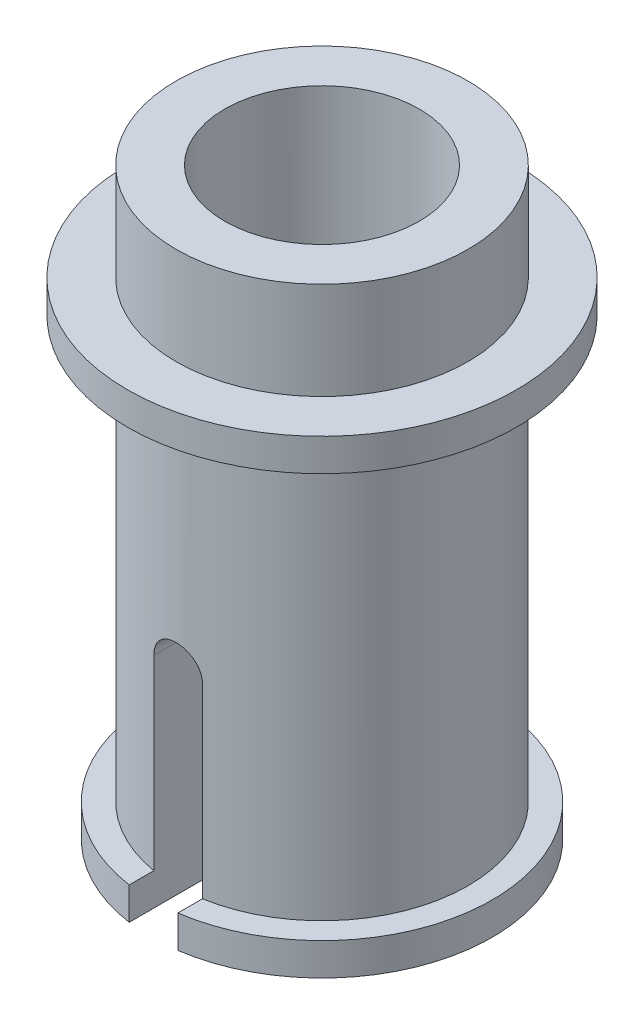
ISO-10303-21;
HEADER;
FILE_DESCRIPTION(('STEP AP214'),'2;1');
FILE_NAME('part.step','',(''),(''),'','','');
FILE_SCHEMA(('AUTOMOTIVE_DESIGN { 1 0 10303 214 1 1 1 1 }'));
ENDSEC;
DATA;
#1=APPLICATION_CONTEXT('core data for automotive mechanical design processes');
#2=APPLICATION_PROTOCOL_DEFINITION('international standard','automotive_design',2000,#1);
#3=PRODUCT_CONTEXT('',#1,'mechanical');
#4=PRODUCT('Part','Part','',(#3));
#5=PRODUCT_RELATED_PRODUCT_CATEGORY('part','',(#4));
#6=PRODUCT_DEFINITION_FORMATION('','',#4);
#7=PRODUCT_DEFINITION_CONTEXT('part definition',#1,'design');
#8=PRODUCT_DEFINITION('design','',#6,#7);
#9=PRODUCT_DEFINITION_SHAPE('','',#8);
#10=(LENGTH_UNIT() NAMED_UNIT(*) SI_UNIT(.MILLI.,.METRE.));
#11=(NAMED_UNIT(*) PLANE_ANGLE_UNIT() SI_UNIT($,.RADIAN.));
#12=(NAMED_UNIT(*) SI_UNIT($,.STERADIAN.) SOLID_ANGLE_UNIT());
#13=UNCERTAINTY_MEASURE_WITH_UNIT(LENGTH_MEASURE(1.E-05),#10,'distance_accuracy_value','');
#14=(GEOMETRIC_REPRESENTATION_CONTEXT(3) GLOBAL_UNCERTAINTY_ASSIGNED_CONTEXT((#13)) GLOBAL_UNIT_ASSIGNED_CONTEXT((#10,
#11,#12)) REPRESENTATION_CONTEXT('',''));
#15=CARTESIAN_POINT('',(0.,0.,0.));
#16=DIRECTION('',(0.,0.,1.));
#17=DIRECTION('',(1.,0.,0.));
#18=AXIS2_PLACEMENT_3D('',#15,#16,#17);
#19=CARTESIAN_POINT('',(0.,5.,0.));
#20=DIRECTION('',(0.,-1.,0.));
#21=DIRECTION('',(0.,0.,-1.));
#22=AXIS2_PLACEMENT_3D('',#19,#20,#21);
#23=CYLINDRICAL_SURFACE('',#22,1.5);
#24=CARTESIAN_POINT('',(0.,4.66666666666667,0.));
#25=DIRECTION('',(0.,1.,0.));
#26=DIRECTION('',(0.,0.,1.));
#27=AXIS2_PLACEMENT_3D('',#24,#25,#26);
#28=CIRCLE('',#27,1.5);
#29=CARTESIAN_POINT('',(0.,4.66666666666667,1.5));
#30=VERTEX_POINT('',#29);
#31=EDGE_CURVE('E194',#30,#30,#28,.T.);
#32=ORIENTED_EDGE('',*,*,#31,.F.);
#33=EDGE_LOOP('',(#32));
#34=FACE_BOUND('',#33,.T.);
#35=DIRECTION('',(0.,-1.,0.));
#36=VECTOR('',#35,1.);
#37=CARTESIAN_POINT('',(-0.250000000000001,5.,1.4790199457749));
#38=LINE('',#37,#36);
#39=CARTESIAN_POINT('',(-0.25,2.25,1.4790199457749));
#40=VERTEX_POINT('',#39);
#41=CARTESIAN_POINT('',(-0.25,0.333333333333333,1.4790199457749));
#42=VERTEX_POINT('',#41);
#43=EDGE_CURVE('E310',#40,#42,#38,.T.);
#44=ORIENTED_EDGE('',*,*,#43,.F.);
#45=CARTESIAN_POINT('',(0.250000000000001,2.25,1.4790199457749));
#46=CARTESIAN_POINT('',(0.250012402551533,2.26396095683245,1.47901221872577));
#47=CARTESIAN_POINT('',(0.248831345018212,2.27791611938485,1.47921741048472));
#48=CARTESIAN_POINT('',(0.244176500369212,2.30541016199332,1.47999587227818));
#49=CARTESIAN_POINT('',(0.240705722404357,2.31894956403438,1.48056865919225));
#50=CARTESIAN_POINT('',(0.231564174181124,2.34524892864396,1.48202499235244));
#51=CARTESIAN_POINT('',(0.225892920688046,2.35800871929328,1.48290860685375));
#52=CARTESIAN_POINT('',(0.212519368982265,2.38239648919483,1.48488428816452));
#53=CARTESIAN_POINT('',(0.204817044343012,2.39402445371803,1.48597635768617));
#54=CARTESIAN_POINT('',(0.187519228628306,2.41593080757023,1.4882583756911));
#55=CARTESIAN_POINT('',(0.177907829040404,2.42619655698689,1.48944909400201));
#56=CARTESIAN_POINT('',(0.157098237376143,2.44497851689128,1.491787383604));
#57=CARTESIAN_POINT('',(0.145899802485202,2.45349445917116,1.49293494825854));
#58=CARTESIAN_POINT('',(0.122151951774287,2.46858167581452,1.49506576447851));
#59=CARTESIAN_POINT('',(0.109594892662243,2.47514107555226,1.49604799754859));
#60=CARTESIAN_POINT('',(0.0835387910448546,2.4860523548294,1.49772877775239));
#61=CARTESIAN_POINT('',(0.0700398635312745,2.49040450331528,1.49842735944605));
#62=CARTESIAN_POINT('',(0.0426145358003446,2.49673921602822,1.49945672837495));
#63=CARTESIAN_POINT('',(0.0286932203419574,2.49874324410422,1.49979084515831));
#64=CARTESIAN_POINT('',(0.000707863169416745,2.50039158366326,1.50006508076469));
#65=CARTESIAN_POINT('',(-0.0133561722012644,2.50003599956928,1.50000521702303));
#66=CARTESIAN_POINT('',(-0.0410802628902775,2.49699186011671,1.49950085758421));
#67=CARTESIAN_POINT('',(-0.05474294084704,2.49432646686981,1.49906018069639));
#68=CARTESIAN_POINT('',(-0.0814242809166854,2.48677486104158,1.49784797400948));
#69=CARTESIAN_POINT('',(-0.0944429275130372,2.48188859498202,1.49707643624335));
#70=CARTESIAN_POINT('',(-0.11953584969667,2.4700108264475,1.49528268120945));
#71=CARTESIAN_POINT('',(-0.131605505418691,2.46300974272845,1.49425932707671));
#72=CARTESIAN_POINT('',(-0.154406950855713,2.44710838032663,1.49207569682498));
#73=CARTESIAN_POINT('',(-0.165138681995882,2.43820801853899,1.49091541471556));
#74=CARTESIAN_POINT('',(-0.185095754958703,2.41863349651485,1.48857042314863));
#75=CARTESIAN_POINT('',(-0.194301454502455,2.40793931445142,1.48738558768296));
#76=CARTESIAN_POINT('',(-0.210793395600476,2.38514456844212,1.48513828313712));
#77=CARTESIAN_POINT('',(-0.218079089892693,2.37304360493252,1.48407584899365));
#78=CARTESIAN_POINT('',(-0.230529023100574,2.34775214208037,1.48219297916677));
#79=CARTESIAN_POINT('',(-0.235689657078123,2.33455983653606,1.48137295536583));
#80=CARTESIAN_POINT('',(-0.243706410032311,2.3074944232718,1.48007591486501));
#81=CARTESIAN_POINT('',(-0.246565974481918,2.29362236653597,1.47959838545312));
#82=CARTESIAN_POINT('',(-0.249414284585126,2.26978500932565,1.47911853225327));
#83=CARTESIAN_POINT('',(-0.250005433378814,2.25989054232892,1.47901686648485));
#84=CARTESIAN_POINT('',(-0.250000000000001,2.25,1.47901994577491));
#85=B_SPLINE_CURVE_WITH_KNOTS('',3,(#45,#46,#47,#48,#49,#50,#51,#52,#53,#54,#55,#56,#57,#58,#59,
#60,#61,#62,#63,#64,#65,#66,#67,#68,#69,#70,#71,#72,#73,#74,#75,#76,#77,#78,#79,#80,#81,#82,#83,
#84),.UNSPECIFIED.,.F.,.F.,(4,2,2,2,2,2,2,2,2,2,2,2,2,2,2,2,2,2,2,4),(0.,0.0418228026426395,
0.083590750953894,0.125367876897847,0.167145546436639,0.209287179345357,0.251435266850384,
0.293834184215329,0.336227934166393,0.378231068338879,0.420232343704392,0.461817252795841,
0.503403163297524,0.54518038008816,0.586959425258929,0.629240298269244,0.671533209659102,
0.71389757379739,0.756198385617119,0.785863044728452),.UNSPECIFIED.);
#86=CARTESIAN_POINT('',(0.25,2.25,1.4790199457749));
#87=VERTEX_POINT('',#86);
#88=EDGE_CURVE('E229',#87,#40,#85,.T.);
#89=ORIENTED_EDGE('',*,*,#88,.F.);
#90=DIRECTION('',(0.,-1.,0.));
#91=VECTOR('',#90,1.);
#92=CARTESIAN_POINT('',(0.250000000000001,5.,1.4790199457749));
#93=LINE('',#92,#91);
#94=CARTESIAN_POINT('',(0.25,0.333333333333333,1.4790199457749));
#95=VERTEX_POINT('',#94);
#96=EDGE_CURVE('E178',#87,#95,#93,.T.);
#97=ORIENTED_EDGE('',*,*,#96,.T.);
#98=CARTESIAN_POINT('',(0.,0.333333333333333,0.));
#99=DIRECTION('',(0.,1.,0.));
#100=DIRECTION('',(0.,0.,1.));
#101=AXIS2_PLACEMENT_3D('',#98,#99,#100);
#102=CIRCLE('',#101,1.5);
#103=CARTESIAN_POINT('',(0.25,0.333333333333333,-1.4790199457749));
#104=VERTEX_POINT('',#103);
#105=EDGE_CURVE('E186',#95,#104,#102,.T.);
#106=ORIENTED_EDGE('',*,*,#105,.T.);
#107=DIRECTION('',(0.,-1.,0.));
#108=VECTOR('',#107,1.);
#109=CARTESIAN_POINT('',(0.250000000000001,5.,-1.4790199457749));
#110=LINE('',#109,#108);
#111=CARTESIAN_POINT('',(0.25,2.25,-1.4790199457749));
#112=VERTEX_POINT('',#111);
#113=EDGE_CURVE('E93',#104,#112,#110,.F.);
#114=ORIENTED_EDGE('',*,*,#113,.T.);
#115=CARTESIAN_POINT('',(-0.250000000000001,2.25,-1.4790199457749));
#116=CARTESIAN_POINT('',(-0.250012402551533,2.26396095683245,-1.47901221872577));
#117=CARTESIAN_POINT('',(-0.248831345018212,2.27791611938485,-1.47921741048472));
#118=CARTESIAN_POINT('',(-0.244176500369212,2.30541016199332,-1.47999587227818));
#119=CARTESIAN_POINT('',(-0.240705722404357,2.31894956403438,-1.48056865919225));
#120=CARTESIAN_POINT('',(-0.231564174181124,2.34524892864396,-1.48202499235244));
#121=CARTESIAN_POINT('',(-0.225892920688046,2.35800871929328,-1.48290860685375));
#122=CARTESIAN_POINT('',(-0.212519368982265,2.38239648919483,-1.48488428816452));
#123=CARTESIAN_POINT('',(-0.204817044343012,2.39402445371803,-1.48597635768617));
#124=CARTESIAN_POINT('',(-0.187519228628306,2.41593080757023,-1.4882583756911));
#125=CARTESIAN_POINT('',(-0.177907829040404,2.42619655698689,-1.48944909400201));
#126=CARTESIAN_POINT('',(-0.157098237376143,2.44497851689128,-1.491787383604));
#127=CARTESIAN_POINT('',(-0.145899802485202,2.45349445917116,-1.49293494825854));
#128=CARTESIAN_POINT('',(-0.122151951774287,2.46858167581452,-1.49506576447851));
#129=CARTESIAN_POINT('',(-0.109594892662243,2.47514107555226,-1.49604799754859));
#130=CARTESIAN_POINT('',(-0.0835387910448546,2.4860523548294,-1.49772877775239));
#131=CARTESIAN_POINT('',(-0.0700398635312745,2.49040450331528,-1.49842735944605));
#132=CARTESIAN_POINT('',(-0.0426145358003446,2.49673921602822,-1.49945672837495));
#133=CARTESIAN_POINT('',(-0.0286932203419574,2.49874324410422,-1.49979084515831));
#134=CARTESIAN_POINT('',(-0.000707863169416745,2.50039158366326,-1.50006508076469));
#135=CARTESIAN_POINT('',(0.0133561722012644,2.50003599956928,-1.50000521702303));
#136=CARTESIAN_POINT('',(0.0410802628902775,2.49699186011671,-1.49950085758421));
#137=CARTESIAN_POINT('',(0.05474294084704,2.49432646686981,-1.49906018069639));
#138=CARTESIAN_POINT('',(0.0814242809166854,2.48677486104158,-1.49784797400948));
#139=CARTESIAN_POINT('',(0.0944429275130372,2.48188859498202,-1.49707643624335));
#140=CARTESIAN_POINT('',(0.11953584969667,2.4700108264475,-1.49528268120945));
#141=CARTESIAN_POINT('',(0.131605505418691,2.46300974272845,-1.49425932707671));
#142=CARTESIAN_POINT('',(0.154406950855713,2.44710838032663,-1.49207569682498));
#143=CARTESIAN_POINT('',(0.165138681995882,2.43820801853899,-1.49091541471556));
#144=CARTESIAN_POINT('',(0.185095754958703,2.41863349651485,-1.48857042314863));
#145=CARTESIAN_POINT('',(0.194301454502455,2.40793931445142,-1.48738558768296));
#146=CARTESIAN_POINT('',(0.210793395600476,2.38514456844212,-1.48513828313712));
#147=CARTESIAN_POINT('',(0.218079089892693,2.37304360493252,-1.48407584899365));
#148=CARTESIAN_POINT('',(0.230529023100574,2.34775214208037,-1.48219297916677));
#149=CARTESIAN_POINT('',(0.235689657078123,2.33455983653606,-1.48137295536583));
#150=CARTESIAN_POINT('',(0.243706410032311,2.3074944232718,-1.48007591486501));
#151=CARTESIAN_POINT('',(0.246565974481918,2.29362236653597,-1.47959838545312));
#152=CARTESIAN_POINT('',(0.249414284585126,2.26978500932565,-1.47911853225327));
#153=CARTESIAN_POINT('',(0.250005433378814,2.25989054232892,-1.47901686648485));
#154=CARTESIAN_POINT('',(0.250000000000001,2.25,-1.47901994577491));
#155=B_SPLINE_CURVE_WITH_KNOTS('',3,(#115,#116,#117,#118,#119,#120,#121,#122,#123,#124,#125,
#126,#127,#128,#129,#130,#131,#132,#133,#134,#135,#136,#137,#138,#139,#140,#141,#142,#143,#144,
#145,#146,#147,#148,#149,#150,#151,#152,#153,#154),.UNSPECIFIED.,.F.,.F.,(4,2,2,2,2,2,2,2,2,2,2,
2,2,2,2,2,2,2,2,4),(0.,0.0418228026426395,0.083590750953894,0.125367876897847,0.167145546436639,
0.209287179345357,0.251435266850384,0.293834184215329,0.336227934166393,0.378231068338879,
0.420232343704392,0.461817252795841,0.503403163297524,0.54518038008816,0.586959425258929,
0.629240298269244,0.671533209659102,0.71389757379739,0.756198385617119,0.785863044728452),.UNSPECIFIED.);
#156=CARTESIAN_POINT('',(-0.25,2.25,-1.4790199457749));
#157=VERTEX_POINT('',#156);
#158=EDGE_CURVE('E224',#157,#112,#155,.T.);
#159=ORIENTED_EDGE('',*,*,#158,.F.);
#160=DIRECTION('',(0.,-1.,0.));
#161=VECTOR('',#160,1.);
#162=CARTESIAN_POINT('',(-0.250000000000001,5.,-1.4790199457749));
#163=LINE('',#162,#161);
#164=CARTESIAN_POINT('',(-0.25,0.333333333333333,-1.4790199457749));
#165=VERTEX_POINT('',#164);
#166=EDGE_CURVE('E315',#165,#157,#163,.F.);
#167=ORIENTED_EDGE('',*,*,#166,.F.);
#168=EDGE_CURVE('E182',#165,#42,#102,.T.);
#169=ORIENTED_EDGE('',*,*,#168,.T.);
#170=EDGE_LOOP('',(#44,#89,#97,#106,#114,#159,#167,#169));
#171=FACE_BOUND('',#170,.T.);
#172=ADVANCED_FACE('F65',(#34,#171),#23,.T.);
#173=CARTESIAN_POINT('',(0.,5.,0.));
#174=DIRECTION('',(0.,-1.,0.));
#175=DIRECTION('',(0.,0.,-1.));
#176=AXIS2_PLACEMENT_3D('',#173,#174,#175);
#177=CYLINDRICAL_SURFACE('',#176,1.);
#178=CARTESIAN_POINT('',(0.,6.,0.));
#179=DIRECTION('',(0.,1.,0.));
#180=DIRECTION('',(0.,0.,1.));
#181=AXIS2_PLACEMENT_3D('',#178,#179,#180);
#182=CIRCLE('',#181,1.);
#183=CARTESIAN_POINT('',(0.,6.,1.));
#184=VERTEX_POINT('',#183);
#185=EDGE_CURVE('E280',#184,#184,#182,.F.);
#186=ORIENTED_EDGE('',*,*,#185,.F.);
#187=EDGE_LOOP('',(#186));
#188=FACE_BOUND('',#187,.T.);
#189=CARTESIAN_POINT('',(0.250000000000001,2.25,0.968245836551854));
#190=CARTESIAN_POINT('',(0.250012953215811,2.26383070607813,0.968234049545618));
#191=CARTESIAN_POINT('',(0.24885316138895,2.27765275214075,0.968541877962347));
#192=CARTESIAN_POINT('',(0.244289832798706,2.30486994361927,0.969707324249105));
#193=CARTESIAN_POINT('',(0.240890858126016,2.31826589909795,0.970563824163099));
#194=CARTESIAN_POINT('',(0.231950584629503,2.344279386634,0.9727377402555));
#195=CARTESIAN_POINT('',(0.226409487125331,2.35689699171264,0.974055113119327));
#196=CARTESIAN_POINT('',(0.213353558724008,2.38102834005615,0.976998055593672));
#197=CARTESIAN_POINT('',(0.205838198568213,2.39254178618752,0.978623707814904));
#198=CARTESIAN_POINT('',(0.188871196749019,2.41438583871804,0.982040595501114));
#199=CARTESIAN_POINT('',(0.179384338319469,2.42468868623804,0.983834461354369));
#200=CARTESIAN_POINT('',(0.15881892400221,2.44357555769966,0.987362777210994));
#201=CARTESIAN_POINT('',(0.147740114172737,2.45215930689364,0.989097217680292));
#202=CARTESIAN_POINT('',(0.124114230626837,2.46747774074516,0.992340451273177));
#203=CARTESIAN_POINT('',(0.111548836630201,2.47418497140975,0.993845760516911));
#204=CARTESIAN_POINT('',(0.0854256461644518,2.48538118613491,0.996430866813653));
#205=CARTESIAN_POINT('',(0.0718680456103882,2.48987060676118,0.997510747601812));
#206=CARTESIAN_POINT('',(0.0444360275333465,2.49641474752203,0.999104749704139));
#207=CARTESIAN_POINT('',(0.0305735806083578,2.4985169179257,0.999629882170623));
#208=CARTESIAN_POINT('',(0.00268319381278971,2.50037584306581,1.00009359545966));
#209=CARTESIAN_POINT('',(-0.0113447250357141,2.50013289259581,1.00003225000546));
#210=CARTESIAN_POINT('',(-0.0388381232151202,2.49734250903197,0.999338093392974));
#211=CARTESIAN_POINT('',(-0.0523091754274915,2.49484634583761,0.99871799668788));
#212=CARTESIAN_POINT('',(-0.0786346777785581,2.48770283021684,0.996990826596762));
#213=CARTESIAN_POINT('',(-0.0914891006079825,2.48305538261128,0.995883731664611));
#214=CARTESIAN_POINT('',(-0.116351821504132,2.47169967982888,0.993287494403769));
#215=CARTESIAN_POINT('',(-0.128351407400122,2.46497315144064,0.991794984571589));
#216=CARTESIAN_POINT('',(-0.151069157807945,2.44966421754278,0.988589863852097));
#217=CARTESIAN_POINT('',(-0.161787128890332,2.44108153243782,0.986877219821464));
#218=CARTESIAN_POINT('',(-0.18194234742737,2.42203027197852,0.983363915069006));
#219=CARTESIAN_POINT('',(-0.191337275764998,2.41151709086156,0.981562126239374));
#220=CARTESIAN_POINT('',(-0.208242393795093,2.38904253327155,0.978115420664843));
#221=CARTESIAN_POINT('',(-0.215752067555647,2.37708076169189,0.976470546938616));
#222=CARTESIAN_POINT('',(-0.228701177325653,2.3519636005341,0.973519534135928));
#223=CARTESIAN_POINT('',(-0.234129254490507,2.338802133734,0.972215265658711));
#224=CARTESIAN_POINT('',(-0.242675587980693,2.31172076785363,0.970117647619827));
#225=CARTESIAN_POINT('',(-0.245797297306411,2.29780203620287,0.969323534507774));
#226=CARTESIAN_POINT('',(-0.248476158786594,2.27813565481264,0.968638226662376));
#227=CARTESIAN_POINT('',(-0.249047697741107,2.27252007419789,0.968491307756439));
#228=CARTESIAN_POINT('',(-0.249809189424919,2.26127055252149,0.968295156243113));
#229=CARTESIAN_POINT('',(-0.249999759525152,2.25563665600881,0.968245765589992));
#230=CARTESIAN_POINT('',(-0.25000000000001,2.25,0.968245836551973));
#231=B_SPLINE_CURVE_WITH_KNOTS('',3,(#189,#190,#191,#192,#193,#194,#195,#196,#197,#198,#199,
#200,#201,#202,#203,#204,#205,#206,#207,#208,#209,#210,#211,#212,#213,#214,#215,#216,#217,#218,
#219,#220,#221,#222,#223,#224,#225,#226,#227,#228,#229,#230),.UNSPECIFIED.,.F.,.F.,(4,2,2,2,2,2,
2,2,2,2,2,2,2,2,2,2,2,2,2,2,4),(0.,0.0414268569974913,0.0827695712464079,0.124108400994361,
0.165458324149683,0.207622554824989,0.249793518852794,0.292552548213583,0.335303157299057,
0.377188284256308,0.419068146109594,0.460018444166185,0.500970554157592,0.542293354093938,
0.583622382878819,0.626065654304351,0.668520528420415,0.711203880860888,0.753823199296981,
0.770751702253637,0.787652749776197),.UNSPECIFIED.);
#232=CARTESIAN_POINT('',(0.25,2.25,0.968245836551854));
#233=VERTEX_POINT('',#232);
#234=CARTESIAN_POINT('',(-0.25,2.25,0.968245836551854));
#235=VERTEX_POINT('',#234);
#236=EDGE_CURVE('E12',#233,#235,#231,.T.);
#237=ORIENTED_EDGE('',*,*,#236,.T.);
#238=DIRECTION('',(0.,-1.,0.));
#239=VECTOR('',#238,1.);
#240=CARTESIAN_POINT('',(-0.250000000000001,5.,0.968245836551854));
#241=LINE('',#240,#239);
#242=CARTESIAN_POINT('',(-0.25,0.,0.968245836551854));
#243=VERTEX_POINT('',#242);
#244=EDGE_CURVE('E230',#235,#243,#241,.T.);
#245=ORIENTED_EDGE('',*,*,#244,.T.);
#246=CARTESIAN_POINT('',(0.,0.,0.));
#247=DIRECTION('',(0.,1.,0.));
#248=DIRECTION('',(0.,0.,1.));
#249=AXIS2_PLACEMENT_3D('',#246,#247,#248);
#250=CIRCLE('',#249,1.);
#251=CARTESIAN_POINT('',(-0.25,0.,-0.968245836551854));
#252=VERTEX_POINT('',#251);
#253=EDGE_CURVE('E195',#252,#243,#250,.T.);
#254=ORIENTED_EDGE('',*,*,#253,.F.);
#255=DIRECTION('',(0.,-1.,0.));
#256=VECTOR('',#255,1.);
#257=CARTESIAN_POINT('',(-0.250000000000001,5.,-0.968245836551854));
#258=LINE('',#257,#256);
#259=CARTESIAN_POINT('',(-0.25,2.25,-0.968245836551854));
#260=VERTEX_POINT('',#259);
#261=EDGE_CURVE('E306',#252,#260,#258,.F.);
#262=ORIENTED_EDGE('',*,*,#261,.T.);
#263=CARTESIAN_POINT('',(-0.250000000000001,2.25,-0.968245836551854));
#264=CARTESIAN_POINT('',(-0.250012953215811,2.26383070607813,-0.968234049545618));
#265=CARTESIAN_POINT('',(-0.24885316138895,2.27765275214075,-0.968541877962347));
#266=CARTESIAN_POINT('',(-0.244289832798706,2.30486994361927,-0.969707324249105));
#267=CARTESIAN_POINT('',(-0.240890858126016,2.31826589909795,-0.970563824163099));
#268=CARTESIAN_POINT('',(-0.231950584629503,2.344279386634,-0.9727377402555));
#269=CARTESIAN_POINT('',(-0.226409487125331,2.35689699171264,-0.974055113119327));
#270=CARTESIAN_POINT('',(-0.213353558724008,2.38102834005615,-0.976998055593672));
#271=CARTESIAN_POINT('',(-0.205838198568213,2.39254178618752,-0.978623707814904));
#272=CARTESIAN_POINT('',(-0.188871196749019,2.41438583871804,-0.982040595501114));
#273=CARTESIAN_POINT('',(-0.179384338319469,2.42468868623804,-0.983834461354369));
#274=CARTESIAN_POINT('',(-0.15881892400221,2.44357555769966,-0.987362777210994));
#275=CARTESIAN_POINT('',(-0.147740114172737,2.45215930689364,-0.989097217680292));
#276=CARTESIAN_POINT('',(-0.124114230626837,2.46747774074516,-0.992340451273177));
#277=CARTESIAN_POINT('',(-0.111548836630201,2.47418497140975,-0.993845760516911));
#278=CARTESIAN_POINT('',(-0.0854256461644518,2.48538118613491,-0.996430866813653));
#279=CARTESIAN_POINT('',(-0.0718680456103882,2.48987060676118,-0.997510747601812));
#280=CARTESIAN_POINT('',(-0.0444360275333465,2.49641474752203,-0.999104749704139));
#281=CARTESIAN_POINT('',(-0.0305735806083578,2.4985169179257,-0.999629882170623));
#282=CARTESIAN_POINT('',(-0.00268319381278971,2.50037584306581,-1.00009359545966));
#283=CARTESIAN_POINT('',(0.0113447250357141,2.50013289259581,-1.00003225000546));
#284=CARTESIAN_POINT('',(0.0388381232151202,2.49734250903197,-0.999338093392974));
#285=CARTESIAN_POINT('',(0.0523091754274915,2.49484634583761,-0.99871799668788));
#286=CARTESIAN_POINT('',(0.0786346777785581,2.48770283021684,-0.996990826596762));
#287=CARTESIAN_POINT('',(0.0914891006079825,2.48305538261128,-0.995883731664611));
#288=CARTESIAN_POINT('',(0.116351821504132,2.47169967982888,-0.993287494403769));
#289=CARTESIAN_POINT('',(0.128351407400122,2.46497315144064,-0.991794984571589));
#290=CARTESIAN_POINT('',(0.151069157807945,2.44966421754278,-0.988589863852097));
#291=CARTESIAN_POINT('',(0.161787128890332,2.44108153243782,-0.986877219821464));
#292=CARTESIAN_POINT('',(0.18194234742737,2.42203027197852,-0.983363915069006));
#293=CARTESIAN_POINT('',(0.191337275764998,2.41151709086156,-0.981562126239374));
#294=CARTESIAN_POINT('',(0.208242393795093,2.38904253327155,-0.978115420664843));
#295=CARTESIAN_POINT('',(0.215752067555647,2.37708076169189,-0.976470546938616));
#296=CARTESIAN_POINT('',(0.228701177325653,2.3519636005341,-0.973519534135928));
#297=CARTESIAN_POINT('',(0.234129254490507,2.338802133734,-0.972215265658711));
#298=CARTESIAN_POINT('',(0.242675587980693,2.31172076785363,-0.970117647619827));
#299=CARTESIAN_POINT('',(0.245797297306411,2.29780203620287,-0.969323534507774));
#300=CARTESIAN_POINT('',(0.248476158786594,2.27813565481264,-0.968638226662376));
#301=CARTESIAN_POINT('',(0.249047697741107,2.27252007419789,-0.968491307756439));
#302=CARTESIAN_POINT('',(0.249809189424919,2.26127055252149,-0.968295156243113));
#303=CARTESIAN_POINT('',(0.249999759525152,2.25563665600881,-0.968245765589992));
#304=CARTESIAN_POINT('',(0.25000000000001,2.25,-0.968245836551973));
#305=B_SPLINE_CURVE_WITH_KNOTS('',3,(#263,#264,#265,#266,#267,#268,#269,#270,#271,#272,#273,
#274,#275,#276,#277,#278,#279,#280,#281,#282,#283,#284,#285,#286,#287,#288,#289,#290,#291,#292,
#293,#294,#295,#296,#297,#298,#299,#300,#301,#302,#303,#304),.UNSPECIFIED.,.F.,.F.,(4,2,2,2,2,2,
2,2,2,2,2,2,2,2,2,2,2,2,2,2,4),(0.,0.0414268569974913,0.0827695712464079,0.124108400994361,
0.165458324149683,0.207622554824989,0.249793518852794,0.292552548213583,0.335303157299057,
0.377188284256308,0.419068146109594,0.460018444166185,0.500970554157592,0.542293354093938,
0.583622382878819,0.626065654304351,0.668520528420415,0.711203880860888,0.753823199296981,
0.770751702253637,0.787652749776197),.UNSPECIFIED.);
#306=CARTESIAN_POINT('',(0.25,2.25,-0.968245836551854));
#307=VERTEX_POINT('',#306);
#308=EDGE_CURVE('E78',#260,#307,#305,.T.);
#309=ORIENTED_EDGE('',*,*,#308,.T.);
#310=DIRECTION('',(0.,-1.,0.));
#311=VECTOR('',#310,1.);
#312=CARTESIAN_POINT('',(0.250000000000001,5.,-0.968245836551854));
#313=LINE('',#312,#311);
#314=CARTESIAN_POINT('',(0.25,0.,-0.968245836551854));
#315=VERTEX_POINT('',#314);
#316=EDGE_CURVE('E320',#315,#307,#313,.F.);
#317=ORIENTED_EDGE('',*,*,#316,.F.);
#318=CARTESIAN_POINT('',(0.25,0.,0.968245836551854));
#319=VERTEX_POINT('',#318);
#320=EDGE_CURVE('E192',#319,#315,#250,.T.);
#321=ORIENTED_EDGE('',*,*,#320,.F.);
#322=DIRECTION('',(0.,-1.,0.));
#323=VECTOR('',#322,1.);
#324=CARTESIAN_POINT('',(0.250000000000001,5.,0.968245836551854));
#325=LINE('',#324,#323);
#326=EDGE_CURVE('E162',#233,#319,#325,.T.);
#327=ORIENTED_EDGE('',*,*,#326,.F.);
#328=EDGE_LOOP('',(#237,#245,#254,#262,#309,#317,#321,#327));
#329=FACE_BOUND('',#328,.T.);
#330=ADVANCED_FACE('F67',(#188,#329),#177,.F.);
#331=CARTESIAN_POINT('',(0.,0.,0.));
#332=DIRECTION('',(0.,1.,0.));
#333=DIRECTION('',(0.,0.,1.));
#334=AXIS2_PLACEMENT_3D('',#331,#332,#333);
#335=PLANE('',#334);
#336=DIRECTION('',(0.,0.,-1.));
#337=VECTOR('',#336,1.);
#338=CARTESIAN_POINT('',(-0.25,0.,2.));
#339=LINE('',#338,#337);
#340=CARTESIAN_POINT('',(-0.25,0.,1.73205080756888));
#341=VERTEX_POINT('',#340);
#342=EDGE_CURVE('E302',#341,#243,#339,.T.);
#343=ORIENTED_EDGE('',*,*,#342,.F.);
#344=CARTESIAN_POINT('',(0.,0.,0.));
#345=DIRECTION('',(0.,1.,0.));
#346=DIRECTION('',(0.,0.,1.));
#347=AXIS2_PLACEMENT_3D('',#344,#345,#346);
#348=CIRCLE('',#347,1.75);
#349=CARTESIAN_POINT('',(-0.25,0.,-1.73205080756888));
#350=VERTEX_POINT('',#349);
#351=EDGE_CURVE('E183',#350,#341,#348,.T.);
#352=ORIENTED_EDGE('',*,*,#351,.F.);
#353=EDGE_CURVE('E167',#252,#350,#339,.T.);
#354=ORIENTED_EDGE('',*,*,#353,.F.);
#355=ORIENTED_EDGE('',*,*,#253,.T.);
#356=EDGE_LOOP('',(#343,#352,#354,#355));
#357=FACE_BOUND('',#356,.T.);
#358=ADVANCED_FACE('F244',(#357),#335,.F.);
#359=CARTESIAN_POINT('',(0.,0.333333333333333,0.));
#360=DIRECTION('',(0.,-1.,0.));
#361=DIRECTION('',(0.,0.,-1.));
#362=AXIS2_PLACEMENT_3D('',#359,#360,#361);
#363=CYLINDRICAL_SURFACE('',#362,1.75);
#364=DIRECTION('',(0.,-1.,0.));
#365=VECTOR('',#364,1.);
#366=CARTESIAN_POINT('',(-0.25,0.333333333333333,1.73205080756888));
#367=LINE('',#366,#365);
#368=CARTESIAN_POINT('',(-0.25,0.333333333333333,1.73205080756888));
#369=VERTEX_POINT('',#368);
#370=EDGE_CURVE('E311',#369,#341,#367,.T.);
#371=ORIENTED_EDGE('',*,*,#370,.F.);
#372=CARTESIAN_POINT('',(0.,0.333333333333333,0.));
#373=DIRECTION('',(0.,1.,0.));
#374=DIRECTION('',(0.,0.,1.));
#375=AXIS2_PLACEMENT_3D('',#372,#373,#374);
#376=CIRCLE('',#375,1.75);
#377=CARTESIAN_POINT('',(-0.25,0.333333333333333,-1.73205080756888));
#378=VERTEX_POINT('',#377);
#379=EDGE_CURVE('E288',#378,#369,#376,.T.);
#380=ORIENTED_EDGE('',*,*,#379,.F.);
#381=DIRECTION('',(0.,-1.,0.));
#382=VECTOR('',#381,1.);
#383=CARTESIAN_POINT('',(-0.25,0.333333333333333,-1.73205080756888));
#384=LINE('',#383,#382);
#385=EDGE_CURVE('E317',#350,#378,#384,.F.);
#386=ORIENTED_EDGE('',*,*,#385,.F.);
#387=ORIENTED_EDGE('',*,*,#351,.T.);
#388=EDGE_LOOP('',(#371,#380,#386,#387));
#389=FACE_BOUND('',#388,.T.);
#390=ADVANCED_FACE('F252',(#389),#363,.T.);
#391=CARTESIAN_POINT('',(0.,0.333333333333333,0.));
#392=DIRECTION('',(0.,1.,0.));
#393=DIRECTION('',(0.,0.,1.));
#394=AXIS2_PLACEMENT_3D('',#391,#392,#393);
#395=PLANE('',#394);
#396=ORIENTED_EDGE('',*,*,#379,.T.);
#397=DIRECTION('',(0.,0.,-1.));
#398=VECTOR('',#397,1.);
#399=CARTESIAN_POINT('',(-0.25,0.333333333333333,0.));
#400=LINE('',#399,#398);
#401=EDGE_CURVE('E203',#369,#42,#400,.T.);
#402=ORIENTED_EDGE('',*,*,#401,.T.);
#403=ORIENTED_EDGE('',*,*,#168,.F.);
#404=EDGE_CURVE('E201',#165,#378,#400,.T.);
#405=ORIENTED_EDGE('',*,*,#404,.T.);
#406=EDGE_LOOP('',(#396,#402,#403,#405));
#407=FACE_BOUND('',#406,.T.);
#408=ADVANCED_FACE('F247',(#407),#395,.T.);
#409=CARTESIAN_POINT('',(0.,5.,0.));
#410=DIRECTION('',(0.,1.,0.));
#411=DIRECTION('',(0.,0.,1.));
#412=AXIS2_PLACEMENT_3D('',#409,#410,#411);
#413=PLANE('',#412);
#414=CARTESIAN_POINT('',(0.,5.,0.));
#415=DIRECTION('',(0.,1.,0.));
#416=DIRECTION('',(0.,0.,1.));
#417=AXIS2_PLACEMENT_3D('',#414,#415,#416);
#418=CIRCLE('',#417,2.);
#419=CARTESIAN_POINT('',(0.,5.,2.));
#420=VERTEX_POINT('',#419);
#421=EDGE_CURVE('E285',#420,#420,#418,.T.);
#422=ORIENTED_EDGE('',*,*,#421,.T.);
#423=EDGE_LOOP('',(#422));
#424=FACE_BOUND('',#423,.T.);
#425=CARTESIAN_POINT('',(0.,5.,0.));
#426=DIRECTION('',(0.,1.,0.));
#427=DIRECTION('',(0.,0.,1.));
#428=AXIS2_PLACEMENT_3D('',#425,#426,#427);
#429=CIRCLE('',#428,1.5);
#430=CARTESIAN_POINT('',(0.,5.,1.5));
#431=VERTEX_POINT('',#430);
#432=EDGE_CURVE('E277',#431,#431,#429,.T.);
#433=ORIENTED_EDGE('',*,*,#432,.F.);
#434=EDGE_LOOP('',(#433));
#435=FACE_BOUND('',#434,.T.);
#436=ADVANCED_FACE('F243',(#424,#435),#413,.T.);
#437=CARTESIAN_POINT('',(0.25,0.,1.73205080756888));
#438=VERTEX_POINT('',#437);
#439=CARTESIAN_POINT('',(0.25,0.,-1.73205080756888));
#440=VERTEX_POINT('',#439);
#441=EDGE_CURVE('E175',#438,#440,#348,.T.);
#442=ORIENTED_EDGE('',*,*,#441,.F.);
#443=DIRECTION('',(0.,0.,-1.));
#444=VECTOR('',#443,1.);
#445=CARTESIAN_POINT('',(0.25,0.,2.));
#446=LINE('',#445,#444);
#447=EDGE_CURVE('E158',#438,#319,#446,.T.);
#448=ORIENTED_EDGE('',*,*,#447,.T.);
#449=ORIENTED_EDGE('',*,*,#320,.T.);
#450=EDGE_CURVE('E168',#315,#440,#446,.T.);
#451=ORIENTED_EDGE('',*,*,#450,.T.);
#452=EDGE_LOOP('',(#442,#448,#449,#451));
#453=FACE_BOUND('',#452,.T.);
#454=ADVANCED_FACE('F181',(#453),#335,.F.);
#455=CARTESIAN_POINT('',(0.25,0.333333333333333,1.73205080756888));
#456=VERTEX_POINT('',#455);
#457=CARTESIAN_POINT('',(0.25,0.333333333333333,-1.73205080756888));
#458=VERTEX_POINT('',#457);
#459=EDGE_CURVE('E177',#456,#458,#376,.T.);
#460=ORIENTED_EDGE('',*,*,#459,.F.);
#461=DIRECTION('',(0.,-1.,0.));
#462=VECTOR('',#461,1.);
#463=CARTESIAN_POINT('',(0.25,0.333333333333333,1.73205080756888));
#464=LINE('',#463,#462);
#465=EDGE_CURVE('E85',#456,#438,#464,.T.);
#466=ORIENTED_EDGE('',*,*,#465,.T.);
#467=ORIENTED_EDGE('',*,*,#441,.T.);
#468=DIRECTION('',(0.,-1.,0.));
#469=VECTOR('',#468,1.);
#470=CARTESIAN_POINT('',(0.25,0.333333333333333,-1.73205080756888));
#471=LINE('',#470,#469);
#472=EDGE_CURVE('E324',#440,#458,#471,.F.);
#473=ORIENTED_EDGE('',*,*,#472,.T.);
#474=EDGE_LOOP('',(#460,#466,#467,#473));
#475=FACE_BOUND('',#474,.T.);
#476=ADVANCED_FACE('F173',(#475),#363,.T.);
#477=DIRECTION('',(0.,0.,-1.));
#478=VECTOR('',#477,1.);
#479=CARTESIAN_POINT('',(0.25,0.333333333333333,0.));
#480=LINE('',#479,#478);
#481=EDGE_CURVE('E200',#456,#95,#480,.T.);
#482=ORIENTED_EDGE('',*,*,#481,.F.);
#483=ORIENTED_EDGE('',*,*,#459,.T.);
#484=EDGE_CURVE('E198',#104,#458,#480,.T.);
#485=ORIENTED_EDGE('',*,*,#484,.F.);
#486=ORIENTED_EDGE('',*,*,#105,.F.);
#487=EDGE_LOOP('',(#482,#483,#485,#486));
#488=FACE_BOUND('',#487,.T.);
#489=ADVANCED_FACE('F251',(#488),#395,.T.);
#490=CARTESIAN_POINT('',(0.,4.66666666666667,0.));
#491=DIRECTION('',(0.,1.,0.));
#492=DIRECTION('',(0.,0.,1.));
#493=AXIS2_PLACEMENT_3D('',#490,#491,#492);
#494=CYLINDRICAL_SURFACE('',#493,2.);
#495=CARTESIAN_POINT('',(0.,4.66666666666667,0.));
#496=DIRECTION('',(0.,1.,0.));
#497=DIRECTION('',(0.,0.,1.));
#498=AXIS2_PLACEMENT_3D('',#495,#496,#497);
#499=CIRCLE('',#498,2.);
#500=CARTESIAN_POINT('',(0.,4.66666666666667,2.));
#501=VERTEX_POINT('',#500);
#502=EDGE_CURVE('E189',#501,#501,#499,.T.);
#503=ORIENTED_EDGE('',*,*,#502,.T.);
#504=EDGE_LOOP('',(#503));
#505=FACE_BOUND('',#504,.T.);
#506=ORIENTED_EDGE('',*,*,#421,.F.);
#507=EDGE_LOOP('',(#506));
#508=FACE_BOUND('',#507,.T.);
#509=ADVANCED_FACE('F255',(#505,#508),#494,.T.);
#510=CARTESIAN_POINT('',(0.,4.66666666666667,0.));
#511=DIRECTION('',(0.,1.,0.));
#512=DIRECTION('',(0.,0.,1.));
#513=AXIS2_PLACEMENT_3D('',#510,#511,#512);
#514=PLANE('',#513);
#515=ORIENTED_EDGE('',*,*,#31,.T.);
#516=EDGE_LOOP('',(#515));
#517=FACE_BOUND('',#516,.T.);
#518=ORIENTED_EDGE('',*,*,#502,.F.);
#519=EDGE_LOOP('',(#518));
#520=FACE_BOUND('',#519,.T.);
#521=ADVANCED_FACE('F259',(#517,#520),#514,.F.);
#522=CARTESIAN_POINT('',(0.,6.,0.));
#523=DIRECTION('',(0.,-1.,0.));
#524=DIRECTION('',(0.,0.,-1.));
#525=AXIS2_PLACEMENT_3D('',#522,#523,#524);
#526=CYLINDRICAL_SURFACE('',#525,1.5);
#527=CARTESIAN_POINT('',(0.,6.,0.));
#528=DIRECTION('',(0.,1.,0.));
#529=DIRECTION('',(0.,0.,1.));
#530=AXIS2_PLACEMENT_3D('',#527,#528,#529);
#531=CIRCLE('',#530,1.5);
#532=CARTESIAN_POINT('',(0.,6.,1.5));
#533=VERTEX_POINT('',#532);
#534=EDGE_CURVE('E274',#533,#533,#531,.T.);
#535=ORIENTED_EDGE('',*,*,#534,.F.);
#536=EDGE_LOOP('',(#535));
#537=FACE_BOUND('',#536,.T.);
#538=ORIENTED_EDGE('',*,*,#432,.T.);
#539=EDGE_LOOP('',(#538));
#540=FACE_BOUND('',#539,.T.);
#541=ADVANCED_FACE('F262',(#537,#540),#526,.T.);
#542=CARTESIAN_POINT('',(0.,6.,0.));
#543=DIRECTION('',(0.,1.,0.));
#544=DIRECTION('',(0.,0.,1.));
#545=AXIS2_PLACEMENT_3D('',#542,#543,#544);
#546=PLANE('',#545);
#547=ORIENTED_EDGE('',*,*,#534,.T.);
#548=EDGE_LOOP('',(#547));
#549=FACE_BOUND('',#548,.T.);
#550=ORIENTED_EDGE('',*,*,#185,.T.);
#551=EDGE_LOOP('',(#550));
#552=FACE_BOUND('',#551,.T.);
#553=ADVANCED_FACE('F217',(#549,#552),#546,.T.);
#554=CARTESIAN_POINT('',(0.25,2.25,2.));
#555=DIRECTION('',(1.,0.,0.));
#556=DIRECTION('',(0.,1.,0.));
#557=AXIS2_PLACEMENT_3D('',#554,#555,#556);
#558=PLANE('',#557);
#559=ORIENTED_EDGE('',*,*,#316,.T.);
#560=DIRECTION('',(0.,0.,-1.));
#561=VECTOR('',#560,1.);
#562=CARTESIAN_POINT('',(0.25,2.25,2.));
#563=LINE('',#562,#561);
#564=EDGE_CURVE('E332',#307,#112,#563,.T.);
#565=ORIENTED_EDGE('',*,*,#564,.T.);
#566=ORIENTED_EDGE('',*,*,#113,.F.);
#567=ORIENTED_EDGE('',*,*,#484,.T.);
#568=ORIENTED_EDGE('',*,*,#472,.F.);
#569=ORIENTED_EDGE('',*,*,#450,.F.);
#570=EDGE_LOOP('',(#559,#565,#566,#567,#568,#569));
#571=FACE_BOUND('',#570,.T.);
#572=ADVANCED_FACE('F269',(#571),#558,.F.);
#573=CARTESIAN_POINT('',(-0.25,2.25,2.));
#574=DIRECTION('',(1.,0.,0.));
#575=DIRECTION('',(0.,1.,0.));
#576=AXIS2_PLACEMENT_3D('',#573,#574,#575);
#577=PLANE('',#576);
#578=ORIENTED_EDGE('',*,*,#353,.T.);
#579=ORIENTED_EDGE('',*,*,#385,.T.);
#580=ORIENTED_EDGE('',*,*,#404,.F.);
#581=ORIENTED_EDGE('',*,*,#166,.T.);
#582=DIRECTION('',(0.,0.,-1.));
#583=VECTOR('',#582,1.);
#584=CARTESIAN_POINT('',(-0.25,2.25,2.));
#585=LINE('',#584,#583);
#586=EDGE_CURVE('E327',#260,#157,#585,.T.);
#587=ORIENTED_EDGE('',*,*,#586,.F.);
#588=ORIENTED_EDGE('',*,*,#261,.F.);
#589=EDGE_LOOP('',(#578,#579,#580,#581,#587,#588));
#590=FACE_BOUND('',#589,.T.);
#591=ADVANCED_FACE('F347',(#590),#577,.T.);
#592=CARTESIAN_POINT('',(0.,2.25,2.));
#593=DIRECTION('',(0.,0.,-1.));
#594=DIRECTION('',(-1.,0.,0.));
#595=AXIS2_PLACEMENT_3D('',#592,#593,#594);
#596=CYLINDRICAL_SURFACE('',#595,0.250000000000001);
#597=ORIENTED_EDGE('',*,*,#158,.T.);
#598=ORIENTED_EDGE('',*,*,#564,.F.);
#599=ORIENTED_EDGE('',*,*,#308,.F.);
#600=ORIENTED_EDGE('',*,*,#586,.T.);
#601=EDGE_LOOP('',(#597,#598,#599,#600));
#602=FACE_BOUND('',#601,.T.);
#603=ADVANCED_FACE('F214',(#602),#596,.F.);
#604=ORIENTED_EDGE('',*,*,#88,.T.);
#605=EDGE_CURVE('E326',#40,#235,#585,.T.);
#606=ORIENTED_EDGE('',*,*,#605,.T.);
#607=ORIENTED_EDGE('',*,*,#236,.F.);
#608=EDGE_CURVE('E331',#87,#233,#563,.T.);
#609=ORIENTED_EDGE('',*,*,#608,.F.);
#610=EDGE_LOOP('',(#604,#606,#607,#609));
#611=FACE_BOUND('',#610,.T.);
#612=ADVANCED_FACE('F208',(#611),#596,.F.);
#613=ORIENTED_EDGE('',*,*,#605,.F.);
#614=ORIENTED_EDGE('',*,*,#43,.T.);
#615=ORIENTED_EDGE('',*,*,#401,.F.);
#616=ORIENTED_EDGE('',*,*,#370,.T.);
#617=ORIENTED_EDGE('',*,*,#342,.T.);
#618=ORIENTED_EDGE('',*,*,#244,.F.);
#619=EDGE_LOOP('',(#613,#614,#615,#616,#617,#618));
#620=FACE_BOUND('',#619,.T.);
#621=ADVANCED_FACE('F213',(#620),#577,.T.);
#622=ORIENTED_EDGE('',*,*,#326,.T.);
#623=ORIENTED_EDGE('',*,*,#447,.F.);
#624=ORIENTED_EDGE('',*,*,#465,.F.);
#625=ORIENTED_EDGE('',*,*,#481,.T.);
#626=ORIENTED_EDGE('',*,*,#96,.F.);
#627=ORIENTED_EDGE('',*,*,#608,.T.);
#628=EDGE_LOOP('',(#622,#623,#624,#625,#626,#627));
#629=FACE_BOUND('',#628,.T.);
#630=ADVANCED_FACE('F159',(#629),#558,.F.);
#631=CLOSED_SHELL('',(#172,#330,#358,#390,#408,#436,#454,#476,#489,#509,#521,#541,#553,#572,
#591,#603,#612,#621,#630));
#632=MANIFOLD_SOLID_BREP('B2',#631);
#633=ADVANCED_BREP_SHAPE_REPRESENTATION('',(#18,#632),#14);
#634=SHAPE_DEFINITION_REPRESENTATION(#9,#633);
ENDSEC;
END-ISO-10303-21;
